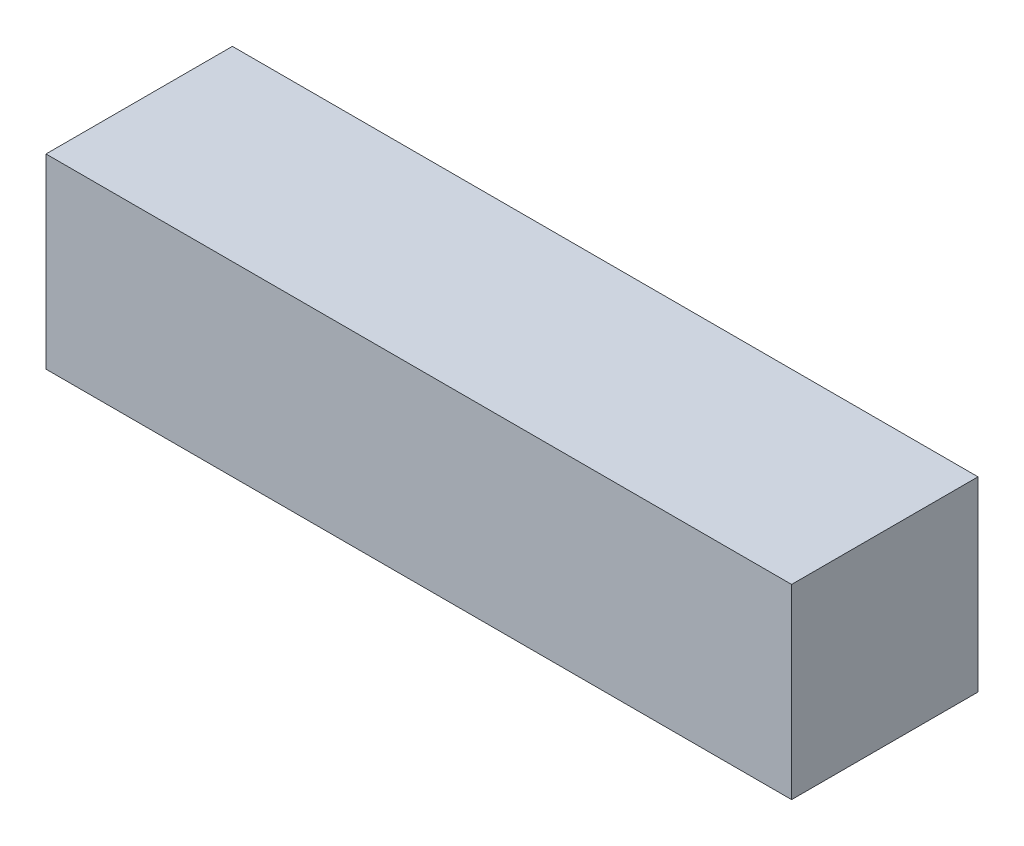
ISO-10303-21;
HEADER;
FILE_DESCRIPTION(('STEP AP214'),'2;1');
FILE_NAME('part.step','',(''),(''),'','','');
FILE_SCHEMA(('AUTOMOTIVE_DESIGN { 1 0 10303 214 1 1 1 1 }'));
ENDSEC;
DATA;
#1=APPLICATION_CONTEXT('core data for automotive mechanical design processes');
#2=APPLICATION_PROTOCOL_DEFINITION('international standard','automotive_design',2000,#1);
#3=PRODUCT_CONTEXT('',#1,'mechanical');
#4=PRODUCT('Part','Part','',(#3));
#5=PRODUCT_RELATED_PRODUCT_CATEGORY('part','',(#4));
#6=PRODUCT_DEFINITION_FORMATION('','',#4);
#7=PRODUCT_DEFINITION_CONTEXT('part definition',#1,'design');
#8=PRODUCT_DEFINITION('design','',#6,#7);
#9=PRODUCT_DEFINITION_SHAPE('','',#8);
#10=(LENGTH_UNIT() NAMED_UNIT(*) SI_UNIT(.MILLI.,.METRE.));
#11=(NAMED_UNIT(*) PLANE_ANGLE_UNIT() SI_UNIT($,.RADIAN.));
#12=(NAMED_UNIT(*) SI_UNIT($,.STERADIAN.) SOLID_ANGLE_UNIT());
#13=UNCERTAINTY_MEASURE_WITH_UNIT(LENGTH_MEASURE(1.E-05),#10,'distance_accuracy_value','');
#14=(GEOMETRIC_REPRESENTATION_CONTEXT(3) GLOBAL_UNCERTAINTY_ASSIGNED_CONTEXT((#13)) GLOBAL_UNIT_ASSIGNED_CONTEXT((#10,
#11,#12)) REPRESENTATION_CONTEXT('',''));
#15=CARTESIAN_POINT('',(0.,0.,0.));
#16=DIRECTION('',(0.,0.,1.));
#17=DIRECTION('',(1.,0.,0.));
#18=AXIS2_PLACEMENT_3D('',#15,#16,#17);
#19=CARTESIAN_POINT('',(-19.9999999999999,10.,-4.99999999999998));
#20=DIRECTION('',(1.,0.,0.));
#21=DIRECTION('',(0.,0.,-1.));
#22=AXIS2_PLACEMENT_3D('',#19,#20,#21);
#23=PLANE('',#22);
#24=DIRECTION('',(0.,0.,1.));
#25=VECTOR('',#24,1.);
#26=CARTESIAN_POINT('',(-19.9999999999999,0.,-4.99999999999998));
#27=LINE('',#26,#25);
#28=CARTESIAN_POINT('',(-19.9999999999999,0.,-4.99999999999998));
#29=VERTEX_POINT('',#28);
#30=CARTESIAN_POINT('',(-19.9999999999999,0.,5.00000000000002));
#31=VERTEX_POINT('',#30);
#32=EDGE_CURVE('E96',#29,#31,#27,.T.);
#33=ORIENTED_EDGE('',*,*,#32,.T.);
#34=DIRECTION('',(0.,-1.,0.));
#35=VECTOR('',#34,1.);
#36=CARTESIAN_POINT('',(-19.9999999999999,10.,5.00000000000002));
#37=LINE('',#36,#35);
#38=CARTESIAN_POINT('',(-19.9999999999999,10.,5.00000000000002));
#39=VERTEX_POINT('',#38);
#40=EDGE_CURVE('E11',#39,#31,#37,.T.);
#41=ORIENTED_EDGE('',*,*,#40,.F.);
#42=DIRECTION('',(0.,0.,1.));
#43=VECTOR('',#42,1.);
#44=CARTESIAN_POINT('',(-19.9999999999999,10.,-4.99999999999998));
#45=LINE('',#44,#43);
#46=CARTESIAN_POINT('',(-19.9999999999999,10.,-4.99999999999998));
#47=VERTEX_POINT('',#46);
#48=EDGE_CURVE('E84',#47,#39,#45,.T.);
#49=ORIENTED_EDGE('',*,*,#48,.F.);
#50=DIRECTION('',(0.,-1.,0.));
#51=VECTOR('',#50,1.);
#52=CARTESIAN_POINT('',(-19.9999999999999,10.,-4.99999999999998));
#53=LINE('',#52,#51);
#54=EDGE_CURVE('E92',#47,#29,#53,.T.);
#55=ORIENTED_EDGE('',*,*,#54,.T.);
#56=EDGE_LOOP('',(#33,#41,#49,#55));
#57=FACE_BOUND('',#56,.T.);
#58=ADVANCED_FACE('F33',(#57),#23,.F.);
#59=CARTESIAN_POINT('',(-19.9999999999999,10.,5.00000000000002));
#60=DIRECTION('',(0.,0.,-1.));
#61=DIRECTION('',(-1.,0.,0.));
#62=AXIS2_PLACEMENT_3D('',#59,#60,#61);
#63=PLANE('',#62);
#64=DIRECTION('',(1.,0.,0.));
#65=VECTOR('',#64,1.);
#66=CARTESIAN_POINT('',(-19.9999999999999,0.,5.00000000000002));
#67=LINE('',#66,#65);
#68=CARTESIAN_POINT('',(20.0000000000001,0.,5.00000000000002));
#69=VERTEX_POINT('',#68);
#70=EDGE_CURVE('E88',#31,#69,#67,.T.);
#71=ORIENTED_EDGE('',*,*,#70,.T.);
#72=DIRECTION('',(0.,-1.,0.));
#73=VECTOR('',#72,1.);
#74=CARTESIAN_POINT('',(20.0000000000001,10.,5.00000000000002));
#75=LINE('',#74,#73);
#76=CARTESIAN_POINT('',(20.0000000000001,10.,5.00000000000002));
#77=VERTEX_POINT('',#76);
#78=EDGE_CURVE('E41',#77,#69,#75,.T.);
#79=ORIENTED_EDGE('',*,*,#78,.F.);
#80=DIRECTION('',(1.,0.,0.));
#81=VECTOR('',#80,1.);
#82=CARTESIAN_POINT('',(-19.9999999999999,10.,5.00000000000002));
#83=LINE('',#82,#81);
#84=EDGE_CURVE('E79',#39,#77,#83,.T.);
#85=ORIENTED_EDGE('',*,*,#84,.F.);
#86=ORIENTED_EDGE('',*,*,#40,.T.);
#87=EDGE_LOOP('',(#71,#79,#85,#86));
#88=FACE_BOUND('',#87,.T.);
#89=ADVANCED_FACE('F87',(#88),#63,.F.);
#90=CARTESIAN_POINT('',(20.,10.,-4.99999999999998));
#91=DIRECTION('',(-1.,0.,0.));
#92=DIRECTION('',(0.,0.,1.));
#93=AXIS2_PLACEMENT_3D('',#90,#91,#92);
#94=PLANE('',#93);
#95=DIRECTION('',(0.,0.,-1.));
#96=VECTOR('',#95,1.);
#97=CARTESIAN_POINT('',(20.,0.,-4.99999999999998));
#98=LINE('',#97,#96);
#99=CARTESIAN_POINT('',(20.,0.,-4.99999999999998));
#100=VERTEX_POINT('',#99);
#101=EDGE_CURVE('E66',#69,#100,#98,.T.);
#102=ORIENTED_EDGE('',*,*,#101,.T.);
#103=DIRECTION('',(0.,-1.,0.));
#104=VECTOR('',#103,1.);
#105=CARTESIAN_POINT('',(20.,10.,-4.99999999999998));
#106=LINE('',#105,#104);
#107=CARTESIAN_POINT('',(20.,10.,-4.99999999999998));
#108=VERTEX_POINT('',#107);
#109=EDGE_CURVE('E89',#108,#100,#106,.T.);
#110=ORIENTED_EDGE('',*,*,#109,.F.);
#111=DIRECTION('',(0.,0.,-1.));
#112=VECTOR('',#111,1.);
#113=CARTESIAN_POINT('',(20.,10.,-4.99999999999998));
#114=LINE('',#113,#112);
#115=EDGE_CURVE('E82',#77,#108,#114,.T.);
#116=ORIENTED_EDGE('',*,*,#115,.F.);
#117=ORIENTED_EDGE('',*,*,#78,.T.);
#118=EDGE_LOOP('',(#102,#110,#116,#117));
#119=FACE_BOUND('',#118,.T.);
#120=ADVANCED_FACE('F90',(#119),#94,.F.);
#121=CARTESIAN_POINT('',(-19.9999999999999,10.,-4.99999999999998));
#122=DIRECTION('',(0.,0.,1.));
#123=DIRECTION('',(1.,0.,0.));
#124=AXIS2_PLACEMENT_3D('',#121,#122,#123);
#125=PLANE('',#124);
#126=DIRECTION('',(-1.,0.,0.));
#127=VECTOR('',#126,1.);
#128=CARTESIAN_POINT('',(-19.9999999999999,0.,-4.99999999999998));
#129=LINE('',#128,#127);
#130=EDGE_CURVE('E72',#100,#29,#129,.T.);
#131=ORIENTED_EDGE('',*,*,#130,.T.);
#132=ORIENTED_EDGE('',*,*,#54,.F.);
#133=DIRECTION('',(-1.,0.,0.));
#134=VECTOR('',#133,1.);
#135=CARTESIAN_POINT('',(-19.9999999999999,10.,-4.99999999999998));
#136=LINE('',#135,#134);
#137=EDGE_CURVE('E49',#108,#47,#136,.T.);
#138=ORIENTED_EDGE('',*,*,#137,.F.);
#139=ORIENTED_EDGE('',*,*,#109,.T.);
#140=EDGE_LOOP('',(#131,#132,#138,#139));
#141=FACE_BOUND('',#140,.T.);
#142=ADVANCED_FACE('F103',(#141),#125,.F.);
#143=CARTESIAN_POINT('',(0.,10.,0.));
#144=DIRECTION('',(0.,1.,0.));
#145=DIRECTION('',(0.,0.,1.));
#146=AXIS2_PLACEMENT_3D('',#143,#144,#145);
#147=PLANE('',#146);
#148=ORIENTED_EDGE('',*,*,#48,.T.);
#149=ORIENTED_EDGE('',*,*,#84,.T.);
#150=ORIENTED_EDGE('',*,*,#115,.T.);
#151=ORIENTED_EDGE('',*,*,#137,.T.);
#152=EDGE_LOOP('',(#148,#149,#150,#151));
#153=FACE_BOUND('',#152,.T.);
#154=ADVANCED_FACE('F80',(#153),#147,.T.);
#155=CARTESIAN_POINT('',(0.,0.,0.));
#156=DIRECTION('',(0.,1.,0.));
#157=DIRECTION('',(0.,0.,1.));
#158=AXIS2_PLACEMENT_3D('',#155,#156,#157);
#159=PLANE('',#158);
#160=ORIENTED_EDGE('',*,*,#32,.F.);
#161=ORIENTED_EDGE('',*,*,#130,.F.);
#162=ORIENTED_EDGE('',*,*,#101,.F.);
#163=ORIENTED_EDGE('',*,*,#70,.F.);
#164=EDGE_LOOP('',(#160,#161,#162,#163));
#165=FACE_BOUND('',#164,.T.);
#166=ADVANCED_FACE('F106',(#165),#159,.F.);
#167=CLOSED_SHELL('',(#58,#89,#120,#142,#154,#166));
#168=MANIFOLD_SOLID_BREP('B2',#167);
#169=ADVANCED_BREP_SHAPE_REPRESENTATION('',(#18,#168),#14);
#170=SHAPE_DEFINITION_REPRESENTATION(#9,#169);
ENDSEC;
END-ISO-10303-21;
